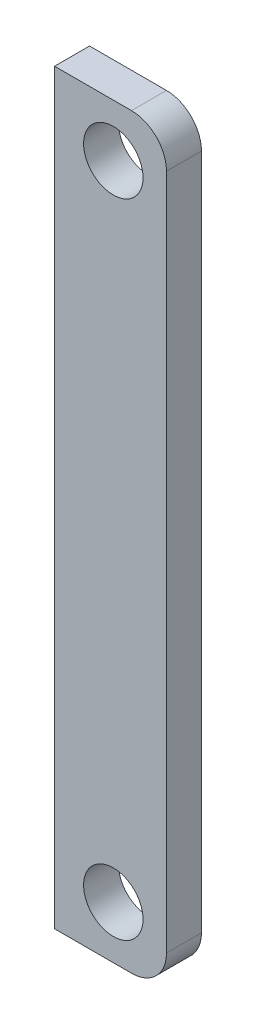
ISO-10303-21;
HEADER;
FILE_DESCRIPTION(('STEP AP214'),'2;1');
FILE_NAME('part.step','',(''),(''),'','','');
FILE_SCHEMA(('AUTOMOTIVE_DESIGN { 1 0 10303 214 1 1 1 1 }'));
ENDSEC;
DATA;
#1=APPLICATION_CONTEXT('core data for automotive mechanical design processes');
#2=APPLICATION_PROTOCOL_DEFINITION('international standard','automotive_design',2000,#1);
#3=PRODUCT_CONTEXT('',#1,'mechanical');
#4=PRODUCT('Part','Part','',(#3));
#5=PRODUCT_RELATED_PRODUCT_CATEGORY('part','',(#4));
#6=PRODUCT_DEFINITION_FORMATION('','',#4);
#7=PRODUCT_DEFINITION_CONTEXT('part definition',#1,'design');
#8=PRODUCT_DEFINITION('design','',#6,#7);
#9=PRODUCT_DEFINITION_SHAPE('','',#8);
#10=(LENGTH_UNIT() NAMED_UNIT(*) SI_UNIT(.MILLI.,.METRE.));
#11=(NAMED_UNIT(*) PLANE_ANGLE_UNIT() SI_UNIT($,.RADIAN.));
#12=(NAMED_UNIT(*) SI_UNIT($,.STERADIAN.) SOLID_ANGLE_UNIT());
#13=UNCERTAINTY_MEASURE_WITH_UNIT(LENGTH_MEASURE(1.E-05),#10,'distance_accuracy_value','');
#14=(GEOMETRIC_REPRESENTATION_CONTEXT(3) GLOBAL_UNCERTAINTY_ASSIGNED_CONTEXT((#13)) GLOBAL_UNIT_ASSIGNED_CONTEXT((#10,
#11,#12)) REPRESENTATION_CONTEXT('',''));
#15=CARTESIAN_POINT('',(0.,0.,0.));
#16=DIRECTION('',(0.,0.,1.));
#17=DIRECTION('',(1.,0.,0.));
#18=AXIS2_PLACEMENT_3D('',#15,#16,#17);
#19=CARTESIAN_POINT('',(35.2,19.36,1.));
#20=DIRECTION('',(0.,0.,-1.));
#21=DIRECTION('',(-1.,0.,0.));
#22=AXIS2_PLACEMENT_3D('',#19,#20,#21);
#23=CYLINDRICAL_SURFACE('',#22,2.);
#24=CARTESIAN_POINT('',(35.2,19.36,-1.));
#25=DIRECTION('',(0.,0.,1.));
#26=DIRECTION('',(1.,0.,0.));
#27=AXIS2_PLACEMENT_3D('',#24,#25,#26);
#28=CIRCLE('',#27,2.);
#29=CARTESIAN_POINT('',(35.2,21.36,-1.));
#30=VERTEX_POINT('',#29);
#31=CARTESIAN_POINT('',(37.2,19.36,-1.));
#32=VERTEX_POINT('',#31);
#33=EDGE_CURVE('E124',#30,#32,#28,.F.);
#34=ORIENTED_EDGE('',*,*,#33,.F.);
#35=DIRECTION('',(0.,0.,-1.));
#36=VECTOR('',#35,1.);
#37=CARTESIAN_POINT('',(35.2,21.36,1.));
#38=LINE('',#37,#36);
#39=CARTESIAN_POINT('',(35.2,21.36,1.));
#40=VERTEX_POINT('',#39);
#41=EDGE_CURVE('E11',#40,#30,#38,.T.);
#42=ORIENTED_EDGE('',*,*,#41,.F.);
#43=CARTESIAN_POINT('',(35.2,19.36,1.));
#44=DIRECTION('',(0.,0.,1.));
#45=DIRECTION('',(1.,0.,0.));
#46=AXIS2_PLACEMENT_3D('',#43,#44,#45);
#47=CIRCLE('',#46,2.);
#48=CARTESIAN_POINT('',(37.2,19.36,1.));
#49=VERTEX_POINT('',#48);
#50=EDGE_CURVE('E143',#40,#49,#47,.F.);
#51=ORIENTED_EDGE('',*,*,#50,.T.);
#52=DIRECTION('',(0.,0.,-1.));
#53=VECTOR('',#52,1.);
#54=CARTESIAN_POINT('',(37.2,19.36,1.));
#55=LINE('',#54,#53);
#56=EDGE_CURVE('E51',#49,#32,#55,.T.);
#57=ORIENTED_EDGE('',*,*,#56,.T.);
#58=EDGE_LOOP('',(#34,#42,#51,#57));
#59=FACE_BOUND('',#58,.T.);
#60=ADVANCED_FACE('F35',(#59),#23,.T.);
#61=CARTESIAN_POINT('',(0.,21.36,1.));
#62=DIRECTION('',(0.,1.,0.));
#63=DIRECTION('',(-1.,0.,0.));
#64=AXIS2_PLACEMENT_3D('',#61,#62,#63);
#65=PLANE('',#64);
#66=DIRECTION('',(1.,0.,0.));
#67=VECTOR('',#66,1.);
#68=CARTESIAN_POINT('',(0.,21.36,-1.));
#69=LINE('',#68,#67);
#70=CARTESIAN_POINT('',(30.8,21.36,-1.));
#71=VERTEX_POINT('',#70);
#72=EDGE_CURVE('E126',#71,#30,#69,.T.);
#73=ORIENTED_EDGE('',*,*,#72,.F.);
#74=DIRECTION('',(0.,0.,-1.));
#75=VECTOR('',#74,1.);
#76=CARTESIAN_POINT('',(30.8,21.36,1.));
#77=LINE('',#76,#75);
#78=CARTESIAN_POINT('',(30.8,21.36,1.));
#79=VERTEX_POINT('',#78);
#80=EDGE_CURVE('E43',#79,#71,#77,.T.);
#81=ORIENTED_EDGE('',*,*,#80,.F.);
#82=DIRECTION('',(1.,0.,0.));
#83=VECTOR('',#82,1.);
#84=CARTESIAN_POINT('',(0.,21.36,1.));
#85=LINE('',#84,#83);
#86=EDGE_CURVE('E156',#79,#40,#85,.T.);
#87=ORIENTED_EDGE('',*,*,#86,.T.);
#88=ORIENTED_EDGE('',*,*,#41,.T.);
#89=EDGE_LOOP('',(#73,#81,#87,#88));
#90=FACE_BOUND('',#89,.T.);
#91=ADVANCED_FACE('F155',(#90),#65,.T.);
#92=CARTESIAN_POINT('',(30.8,0.,1.));
#93=DIRECTION('',(1.,0.,0.));
#94=DIRECTION('',(0.,0.,-1.));
#95=AXIS2_PLACEMENT_3D('',#92,#93,#94);
#96=PLANE('',#95);
#97=DIRECTION('',(0.,-1.,0.));
#98=VECTOR('',#97,1.);
#99=CARTESIAN_POINT('',(30.8,0.,-1.));
#100=LINE('',#99,#98);
#101=CARTESIAN_POINT('',(30.8,-21.36,-1.));
#102=VERTEX_POINT('',#101);
#103=EDGE_CURVE('E129',#71,#102,#100,.T.);
#104=ORIENTED_EDGE('',*,*,#103,.T.);
#105=DIRECTION('',(0.,0.,-1.));
#106=VECTOR('',#105,1.);
#107=CARTESIAN_POINT('',(30.8,-21.36,1.));
#108=LINE('',#107,#106);
#109=CARTESIAN_POINT('',(30.8,-21.36,1.));
#110=VERTEX_POINT('',#109);
#111=EDGE_CURVE('E110',#110,#102,#108,.T.);
#112=ORIENTED_EDGE('',*,*,#111,.F.);
#113=DIRECTION('',(0.,-1.,0.));
#114=VECTOR('',#113,1.);
#115=CARTESIAN_POINT('',(30.8,0.,1.));
#116=LINE('',#115,#114);
#117=EDGE_CURVE('E98',#79,#110,#116,.T.);
#118=ORIENTED_EDGE('',*,*,#117,.F.);
#119=ORIENTED_EDGE('',*,*,#80,.T.);
#120=EDGE_LOOP('',(#104,#112,#118,#119));
#121=FACE_BOUND('',#120,.T.);
#122=ADVANCED_FACE('F148',(#121),#96,.F.);
#123=CARTESIAN_POINT('',(0.,-21.36,1.));
#124=DIRECTION('',(0.,1.,0.));
#125=DIRECTION('',(-1.,0.,0.));
#126=AXIS2_PLACEMENT_3D('',#123,#124,#125);
#127=PLANE('',#126);
#128=DIRECTION('',(1.,0.,0.));
#129=VECTOR('',#128,1.);
#130=CARTESIAN_POINT('',(0.,-21.36,-1.));
#131=LINE('',#130,#129);
#132=CARTESIAN_POINT('',(35.2,-21.36,-1.));
#133=VERTEX_POINT('',#132);
#134=EDGE_CURVE('E107',#102,#133,#131,.T.);
#135=ORIENTED_EDGE('',*,*,#134,.T.);
#136=DIRECTION('',(0.,0.,-1.));
#137=VECTOR('',#136,1.);
#138=CARTESIAN_POINT('',(35.2,-21.36,1.));
#139=LINE('',#138,#137);
#140=CARTESIAN_POINT('',(35.2,-21.36,1.));
#141=VERTEX_POINT('',#140);
#142=EDGE_CURVE('E104',#141,#133,#139,.T.);
#143=ORIENTED_EDGE('',*,*,#142,.F.);
#144=DIRECTION('',(1.,0.,0.));
#145=VECTOR('',#144,1.);
#146=CARTESIAN_POINT('',(0.,-21.36,1.));
#147=LINE('',#146,#145);
#148=EDGE_CURVE('E89',#110,#141,#147,.T.);
#149=ORIENTED_EDGE('',*,*,#148,.F.);
#150=ORIENTED_EDGE('',*,*,#111,.T.);
#151=EDGE_LOOP('',(#135,#143,#149,#150));
#152=FACE_BOUND('',#151,.T.);
#153=ADVANCED_FACE('F105',(#152),#127,.F.);
#154=CARTESIAN_POINT('',(35.2,-19.36,1.));
#155=DIRECTION('',(0.,0.,-1.));
#156=DIRECTION('',(-1.,0.,0.));
#157=AXIS2_PLACEMENT_3D('',#154,#155,#156);
#158=CYLINDRICAL_SURFACE('',#157,2.);
#159=CARTESIAN_POINT('',(35.2,-19.36,-1.));
#160=DIRECTION('',(0.,0.,1.));
#161=DIRECTION('',(1.,0.,0.));
#162=AXIS2_PLACEMENT_3D('',#159,#160,#161);
#163=CIRCLE('',#162,2.);
#164=CARTESIAN_POINT('',(37.2,-19.36,-1.));
#165=VERTEX_POINT('',#164);
#166=EDGE_CURVE('E132',#133,#165,#163,.T.);
#167=ORIENTED_EDGE('',*,*,#166,.T.);
#168=DIRECTION('',(0.,0.,-1.));
#169=VECTOR('',#168,1.);
#170=CARTESIAN_POINT('',(37.2,-19.36,1.));
#171=LINE('',#170,#169);
#172=CARTESIAN_POINT('',(37.2,-19.36,1.));
#173=VERTEX_POINT('',#172);
#174=EDGE_CURVE('E71',#173,#165,#171,.T.);
#175=ORIENTED_EDGE('',*,*,#174,.F.);
#176=CARTESIAN_POINT('',(35.2,-19.36,1.));
#177=DIRECTION('',(0.,0.,1.));
#178=DIRECTION('',(1.,0.,0.));
#179=AXIS2_PLACEMENT_3D('',#176,#177,#178);
#180=CIRCLE('',#179,2.);
#181=EDGE_CURVE('E95',#141,#173,#180,.T.);
#182=ORIENTED_EDGE('',*,*,#181,.F.);
#183=ORIENTED_EDGE('',*,*,#142,.T.);
#184=EDGE_LOOP('',(#167,#175,#182,#183));
#185=FACE_BOUND('',#184,.T.);
#186=ADVANCED_FACE('F112',(#185),#158,.T.);
#187=CARTESIAN_POINT('',(34.16,18.36,1.));
#188=DIRECTION('',(0.,0.,-1.));
#189=DIRECTION('',(-1.,0.,0.));
#190=AXIS2_PLACEMENT_3D('',#187,#188,#189);
#191=CYLINDRICAL_SURFACE('',#190,1.7);
#192=CARTESIAN_POINT('',(34.16,18.36,1.));
#193=DIRECTION('',(0.,0.,1.));
#194=DIRECTION('',(1.,0.,0.));
#195=AXIS2_PLACEMENT_3D('',#192,#193,#194);
#196=CIRCLE('',#195,1.7);
#197=CARTESIAN_POINT('',(35.86,18.36,1.));
#198=VERTEX_POINT('',#197);
#199=EDGE_CURVE('E115',#198,#198,#196,.T.);
#200=ORIENTED_EDGE('',*,*,#199,.T.);
#201=EDGE_LOOP('',(#200));
#202=FACE_BOUND('',#201,.T.);
#203=CARTESIAN_POINT('',(34.16,18.36,-1.));
#204=DIRECTION('',(0.,0.,1.));
#205=DIRECTION('',(1.,0.,0.));
#206=AXIS2_PLACEMENT_3D('',#203,#204,#205);
#207=CIRCLE('',#206,1.7);
#208=CARTESIAN_POINT('',(35.86,18.36,-1.));
#209=VERTEX_POINT('',#208);
#210=EDGE_CURVE('E137',#209,#209,#207,.T.);
#211=ORIENTED_EDGE('',*,*,#210,.F.);
#212=EDGE_LOOP('',(#211));
#213=FACE_BOUND('',#212,.T.);
#214=ADVANCED_FACE('F160',(#202,#213),#191,.F.);
#215=CARTESIAN_POINT('',(37.2,0.,1.));
#216=DIRECTION('',(1.,0.,0.));
#217=DIRECTION('',(0.,0.,-1.));
#218=AXIS2_PLACEMENT_3D('',#215,#216,#217);
#219=PLANE('',#218);
#220=DIRECTION('',(0.,-1.,0.));
#221=VECTOR('',#220,1.);
#222=CARTESIAN_POINT('',(37.2,0.,-1.));
#223=LINE('',#222,#221);
#224=EDGE_CURVE('E134',#32,#165,#223,.T.);
#225=ORIENTED_EDGE('',*,*,#224,.F.);
#226=ORIENTED_EDGE('',*,*,#56,.F.);
#227=DIRECTION('',(0.,-1.,0.));
#228=VECTOR('',#227,1.);
#229=CARTESIAN_POINT('',(37.2,0.,1.));
#230=LINE('',#229,#228);
#231=EDGE_CURVE('E113',#49,#173,#230,.T.);
#232=ORIENTED_EDGE('',*,*,#231,.T.);
#233=ORIENTED_EDGE('',*,*,#174,.T.);
#234=EDGE_LOOP('',(#225,#226,#232,#233));
#235=FACE_BOUND('',#234,.T.);
#236=ADVANCED_FACE('F157',(#235),#219,.T.);
#237=CARTESIAN_POINT('',(34.16,-18.36,1.));
#238=DIRECTION('',(0.,0.,-1.));
#239=DIRECTION('',(-1.,0.,0.));
#240=AXIS2_PLACEMENT_3D('',#237,#238,#239);
#241=CYLINDRICAL_SURFACE('',#240,1.7);
#242=CARTESIAN_POINT('',(34.16,-18.36,1.));
#243=DIRECTION('',(0.,0.,1.));
#244=DIRECTION('',(1.,0.,0.));
#245=AXIS2_PLACEMENT_3D('',#242,#243,#244);
#246=CIRCLE('',#245,1.7);
#247=CARTESIAN_POINT('',(35.86,-18.36,1.));
#248=VERTEX_POINT('',#247);
#249=EDGE_CURVE('E121',#248,#248,#246,.T.);
#250=ORIENTED_EDGE('',*,*,#249,.T.);
#251=EDGE_LOOP('',(#250));
#252=FACE_BOUND('',#251,.T.);
#253=CARTESIAN_POINT('',(34.16,-18.36,-1.));
#254=DIRECTION('',(0.,0.,1.));
#255=DIRECTION('',(1.,0.,0.));
#256=AXIS2_PLACEMENT_3D('',#253,#254,#255);
#257=CIRCLE('',#256,1.7);
#258=CARTESIAN_POINT('',(35.86,-18.36,-1.));
#259=VERTEX_POINT('',#258);
#260=EDGE_CURVE('E140',#259,#259,#257,.T.);
#261=ORIENTED_EDGE('',*,*,#260,.F.);
#262=EDGE_LOOP('',(#261));
#263=FACE_BOUND('',#262,.T.);
#264=ADVANCED_FACE('F159',(#252,#263),#241,.F.);
#265=CARTESIAN_POINT('',(0.,0.,1.));
#266=DIRECTION('',(0.,0.,1.));
#267=DIRECTION('',(1.,0.,0.));
#268=AXIS2_PLACEMENT_3D('',#265,#266,#267);
#269=PLANE('',#268);
#270=ORIENTED_EDGE('',*,*,#50,.F.);
#271=ORIENTED_EDGE('',*,*,#86,.F.);
#272=ORIENTED_EDGE('',*,*,#117,.T.);
#273=ORIENTED_EDGE('',*,*,#148,.T.);
#274=ORIENTED_EDGE('',*,*,#181,.T.);
#275=ORIENTED_EDGE('',*,*,#231,.F.);
#276=EDGE_LOOP('',(#270,#271,#272,#273,#274,#275));
#277=FACE_BOUND('',#276,.T.);
#278=ORIENTED_EDGE('',*,*,#199,.F.);
#279=EDGE_LOOP('',(#278));
#280=FACE_BOUND('',#279,.T.);
#281=ORIENTED_EDGE('',*,*,#249,.F.);
#282=EDGE_LOOP('',(#281));
#283=FACE_BOUND('',#282,.T.);
#284=ADVANCED_FACE('F91',(#277,#280,#283),#269,.T.);
#285=CARTESIAN_POINT('',(0.,0.,-1.));
#286=DIRECTION('',(0.,0.,1.));
#287=DIRECTION('',(1.,0.,0.));
#288=AXIS2_PLACEMENT_3D('',#285,#286,#287);
#289=PLANE('',#288);
#290=ORIENTED_EDGE('',*,*,#33,.T.);
#291=ORIENTED_EDGE('',*,*,#224,.T.);
#292=ORIENTED_EDGE('',*,*,#166,.F.);
#293=ORIENTED_EDGE('',*,*,#134,.F.);
#294=ORIENTED_EDGE('',*,*,#103,.F.);
#295=ORIENTED_EDGE('',*,*,#72,.T.);
#296=EDGE_LOOP('',(#290,#291,#292,#293,#294,#295));
#297=FACE_BOUND('',#296,.T.);
#298=ORIENTED_EDGE('',*,*,#210,.T.);
#299=EDGE_LOOP('',(#298));
#300=FACE_BOUND('',#299,.T.);
#301=ORIENTED_EDGE('',*,*,#260,.T.);
#302=EDGE_LOOP('',(#301));
#303=FACE_BOUND('',#302,.T.);
#304=ADVANCED_FACE('F153',(#297,#300,#303),#289,.F.);
#305=CLOSED_SHELL('',(#60,#91,#122,#153,#186,#214,#236,#264,#284,#304));
#306=MANIFOLD_SOLID_BREP('B2',#305);
#307=ADVANCED_BREP_SHAPE_REPRESENTATION('',(#18,#306),#14);
#308=SHAPE_DEFINITION_REPRESENTATION(#9,#307);
ENDSEC;
END-ISO-10303-21;
